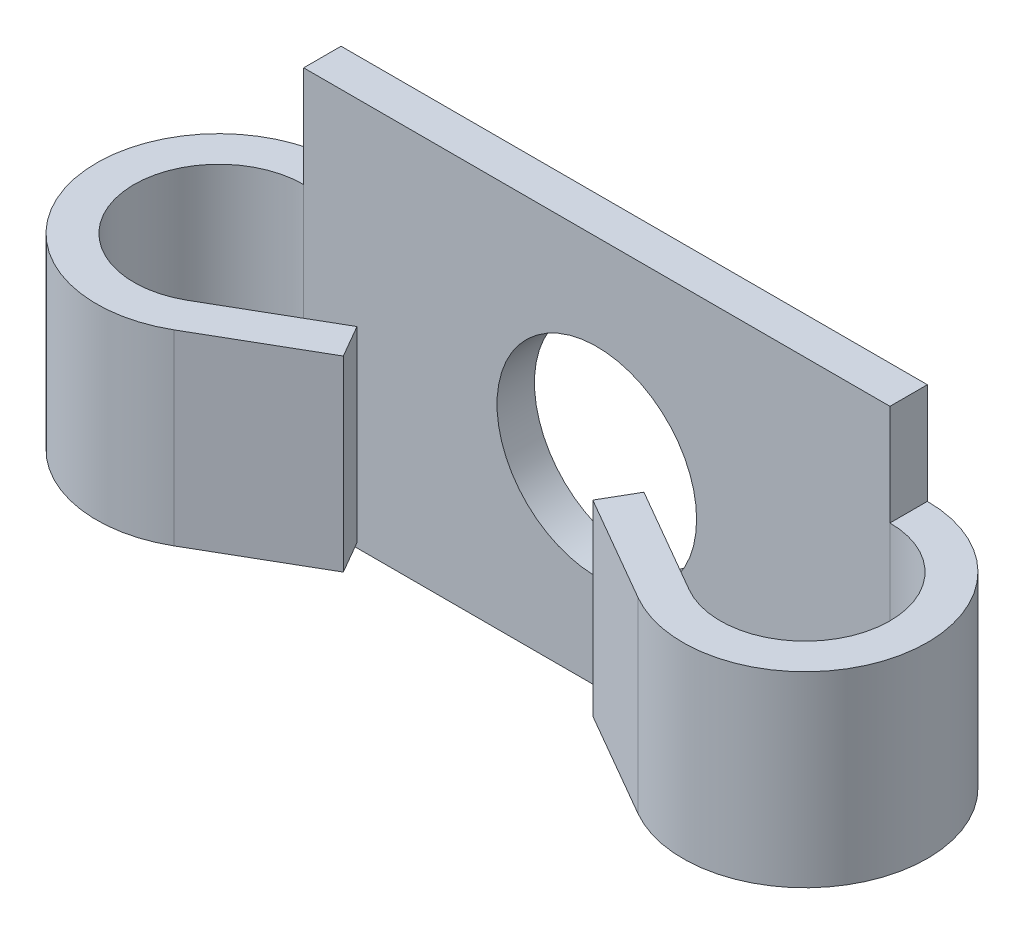
ISO-10303-21;
HEADER;
FILE_DESCRIPTION(('STEP AP214'),'2;1');
FILE_NAME('part.step','',(''),(''),'','','');
FILE_SCHEMA(('AUTOMOTIVE_DESIGN { 1 0 10303 214 1 1 1 1 }'));
ENDSEC;
DATA;
#1=APPLICATION_CONTEXT('core data for automotive mechanical design processes');
#2=APPLICATION_PROTOCOL_DEFINITION('international standard','automotive_design',2000,#1);
#3=PRODUCT_CONTEXT('',#1,'mechanical');
#4=PRODUCT('Part','Part','',(#3));
#5=PRODUCT_RELATED_PRODUCT_CATEGORY('part','',(#4));
#6=PRODUCT_DEFINITION_FORMATION('','',#4);
#7=PRODUCT_DEFINITION_CONTEXT('part definition',#1,'design');
#8=PRODUCT_DEFINITION('design','',#6,#7);
#9=PRODUCT_DEFINITION_SHAPE('','',#8);
#10=(LENGTH_UNIT() NAMED_UNIT(*) SI_UNIT(.MILLI.,.METRE.));
#11=(NAMED_UNIT(*) PLANE_ANGLE_UNIT() SI_UNIT($,.RADIAN.));
#12=(NAMED_UNIT(*) SI_UNIT($,.STERADIAN.) SOLID_ANGLE_UNIT());
#13=UNCERTAINTY_MEASURE_WITH_UNIT(LENGTH_MEASURE(1.E-05),#10,'distance_accuracy_value','');
#14=(GEOMETRIC_REPRESENTATION_CONTEXT(3) GLOBAL_UNCERTAINTY_ASSIGNED_CONTEXT((#13)) GLOBAL_UNIT_ASSIGNED_CONTEXT((#10,
#11,#12)) REPRESENTATION_CONTEXT('',''));
#15=CARTESIAN_POINT('',(0.,0.,0.));
#16=DIRECTION('',(0.,0.,1.));
#17=DIRECTION('',(1.,0.,0.));
#18=AXIS2_PLACEMENT_3D('',#15,#16,#17);
#19=CARTESIAN_POINT('',(11.75,-7.8,1.5));
#20=DIRECTION('',(-1.,0.,0.));
#21=DIRECTION('',(0.,0.,1.));
#22=AXIS2_PLACEMENT_3D('',#19,#20,#21);
#23=PLANE('',#22);
#24=DIRECTION('',(0.,0.,-1.));
#25=VECTOR('',#24,1.);
#26=CARTESIAN_POINT('',(11.75,-3.75,1.5));
#27=LINE('',#26,#25);
#28=CARTESIAN_POINT('',(11.75,-3.75,1.5));
#29=VERTEX_POINT('',#28);
#30=CARTESIAN_POINT('',(11.75,-3.75,0.));
#31=VERTEX_POINT('',#30);
#32=EDGE_CURVE('E58',#29,#31,#27,.T.);
#33=ORIENTED_EDGE('',*,*,#32,.F.);
#34=DIRECTION('',(0.,1.,0.));
#35=VECTOR('',#34,1.);
#36=CARTESIAN_POINT('',(11.75,-7.8,1.5));
#37=LINE('',#36,#35);
#38=CARTESIAN_POINT('',(11.75,-7.8,1.5));
#39=VERTEX_POINT('',#38);
#40=EDGE_CURVE('E258',#39,#29,#37,.T.);
#41=ORIENTED_EDGE('',*,*,#40,.F.);
#42=DIRECTION('',(0.,0.,-1.));
#43=VECTOR('',#42,1.);
#44=CARTESIAN_POINT('',(11.75,-7.8,1.5));
#45=LINE('',#44,#43);
#46=CARTESIAN_POINT('',(11.75,-7.8,0.));
#47=VERTEX_POINT('',#46);
#48=EDGE_CURVE('E268',#39,#47,#45,.T.);
#49=ORIENTED_EDGE('',*,*,#48,.T.);
#50=DIRECTION('',(0.,1.,0.));
#51=VECTOR('',#50,1.);
#52=CARTESIAN_POINT('',(11.75,-7.8,0.));
#53=LINE('',#52,#51);
#54=EDGE_CURVE('E269',#47,#31,#53,.T.);
#55=ORIENTED_EDGE('',*,*,#54,.T.);
#56=EDGE_LOOP('',(#33,#41,#49,#55));
#57=FACE_BOUND('',#56,.T.);
#58=ADVANCED_FACE('F35',(#57),#23,.F.);
#59=CARTESIAN_POINT('',(-11.75,-7.8,1.5));
#60=DIRECTION('',(1.,0.,0.));
#61=DIRECTION('',(0.,0.,-1.));
#62=AXIS2_PLACEMENT_3D('',#59,#60,#61);
#63=PLANE('',#62);
#64=DIRECTION('',(0.,0.,-1.));
#65=VECTOR('',#64,1.);
#66=CARTESIAN_POINT('',(-11.75,-3.75,1.5));
#67=LINE('',#66,#65);
#68=CARTESIAN_POINT('',(-11.75,-3.75,1.5));
#69=VERTEX_POINT('',#68);
#70=CARTESIAN_POINT('',(-11.75,-3.75,0.));
#71=VERTEX_POINT('',#70);
#72=EDGE_CURVE('E226',#69,#71,#67,.T.);
#73=ORIENTED_EDGE('',*,*,#72,.T.);
#74=DIRECTION('',(0.,-1.,0.));
#75=VECTOR('',#74,1.);
#76=CARTESIAN_POINT('',(-11.75,-7.8,0.));
#77=LINE('',#76,#75);
#78=CARTESIAN_POINT('',(-11.75,-7.8,0.));
#79=VERTEX_POINT('',#78);
#80=EDGE_CURVE('E273',#71,#79,#77,.T.);
#81=ORIENTED_EDGE('',*,*,#80,.T.);
#82=DIRECTION('',(0.,0.,-1.));
#83=VECTOR('',#82,1.);
#84=CARTESIAN_POINT('',(-11.75,-7.8,1.5));
#85=LINE('',#84,#83);
#86=CARTESIAN_POINT('',(-11.75,-7.8,1.5));
#87=VERTEX_POINT('',#86);
#88=EDGE_CURVE('E281',#87,#79,#85,.T.);
#89=ORIENTED_EDGE('',*,*,#88,.F.);
#90=DIRECTION('',(0.,-1.,0.));
#91=VECTOR('',#90,1.);
#92=CARTESIAN_POINT('',(-11.75,-7.8,1.5));
#93=LINE('',#92,#91);
#94=EDGE_CURVE('E262',#69,#87,#93,.T.);
#95=ORIENTED_EDGE('',*,*,#94,.F.);
#96=EDGE_LOOP('',(#73,#81,#89,#95));
#97=FACE_BOUND('',#96,.T.);
#98=ADVANCED_FACE('F352',(#97),#63,.F.);
#99=CARTESIAN_POINT('',(0.,0.,1.5));
#100=DIRECTION('',(0.,0.,-1.));
#101=DIRECTION('',(-1.,0.,0.));
#102=AXIS2_PLACEMENT_3D('',#99,#100,#101);
#103=PLANE('',#102);
#104=ORIENTED_EDGE('',*,*,#40,.T.);
#105=DIRECTION('',(0.,-1.,0.));
#106=VECTOR('',#105,1.);
#107=CARTESIAN_POINT('',(11.75,3.75,1.5));
#108=LINE('',#107,#106);
#109=CARTESIAN_POINT('',(11.75,3.75,1.5));
#110=VERTEX_POINT('',#109);
#111=EDGE_CURVE('E185',#110,#29,#108,.T.);
#112=ORIENTED_EDGE('',*,*,#111,.F.);
#113=CARTESIAN_POINT('',(11.75,7.8,1.5));
#114=VERTEX_POINT('',#113);
#115=EDGE_CURVE('E50',#110,#114,#37,.T.);
#116=ORIENTED_EDGE('',*,*,#115,.T.);
#117=DIRECTION('',(-1.,0.,0.));
#118=VECTOR('',#117,1.);
#119=CARTESIAN_POINT('',(-11.75,7.8,1.5));
#120=LINE('',#119,#118);
#121=CARTESIAN_POINT('',(-11.75,7.8,1.5));
#122=VERTEX_POINT('',#121);
#123=EDGE_CURVE('E260',#114,#122,#120,.T.);
#124=ORIENTED_EDGE('',*,*,#123,.T.);
#125=CARTESIAN_POINT('',(-11.75,3.75,1.5));
#126=VERTEX_POINT('',#125);
#127=EDGE_CURVE('E263',#122,#126,#93,.T.);
#128=ORIENTED_EDGE('',*,*,#127,.T.);
#129=DIRECTION('',(0.,-1.,0.));
#130=VECTOR('',#129,1.);
#131=CARTESIAN_POINT('',(-11.75,3.75,1.5));
#132=LINE('',#131,#130);
#133=EDGE_CURVE('E249',#126,#69,#132,.T.);
#134=ORIENTED_EDGE('',*,*,#133,.T.);
#135=ORIENTED_EDGE('',*,*,#94,.T.);
#136=DIRECTION('',(1.,0.,0.));
#137=VECTOR('',#136,1.);
#138=CARTESIAN_POINT('',(-11.75,-7.8,1.5));
#139=LINE('',#138,#137);
#140=EDGE_CURVE('E266',#87,#39,#139,.T.);
#141=ORIENTED_EDGE('',*,*,#140,.T.);
#142=EDGE_LOOP('',(#104,#112,#116,#124,#128,#134,#135,#141));
#143=FACE_BOUND('',#142,.T.);
#144=CARTESIAN_POINT('',(0.,0.,1.5));
#145=DIRECTION('',(0.,0.,1.));
#146=DIRECTION('',(1.,0.,0.));
#147=AXIS2_PLACEMENT_3D('',#144,#145,#146);
#148=CIRCLE('',#147,4.);
#149=CARTESIAN_POINT('',(4.,0.,1.5));
#150=VERTEX_POINT('',#149);
#151=EDGE_CURVE('E252',#150,#150,#148,.T.);
#152=ORIENTED_EDGE('',*,*,#151,.F.);
#153=EDGE_LOOP('',(#152));
#154=FACE_BOUND('',#153,.T.);
#155=ADVANCED_FACE('F326',(#143,#154),#103,.F.);
#156=CARTESIAN_POINT('',(0.,0.,0.));
#157=DIRECTION('',(0.,0.,-1.));
#158=DIRECTION('',(-1.,0.,0.));
#159=AXIS2_PLACEMENT_3D('',#156,#157,#158);
#160=PLANE('',#159);
#161=ORIENTED_EDGE('',*,*,#54,.F.);
#162=DIRECTION('',(1.,0.,0.));
#163=VECTOR('',#162,1.);
#164=CARTESIAN_POINT('',(-11.75,-7.8,0.));
#165=LINE('',#164,#163);
#166=EDGE_CURVE('E277',#79,#47,#165,.T.);
#167=ORIENTED_EDGE('',*,*,#166,.F.);
#168=ORIENTED_EDGE('',*,*,#80,.F.);
#169=DIRECTION('',(0.,-1.,0.));
#170=VECTOR('',#169,1.);
#171=CARTESIAN_POINT('',(-11.75,3.75,0.));
#172=LINE('',#171,#170);
#173=CARTESIAN_POINT('',(-11.75,3.75,0.));
#174=VERTEX_POINT('',#173);
#175=EDGE_CURVE('E246',#174,#71,#172,.T.);
#176=ORIENTED_EDGE('',*,*,#175,.F.);
#177=CARTESIAN_POINT('',(-11.75,7.8,0.));
#178=VERTEX_POINT('',#177);
#179=EDGE_CURVE('E274',#178,#174,#77,.T.);
#180=ORIENTED_EDGE('',*,*,#179,.F.);
#181=DIRECTION('',(-1.,0.,0.));
#182=VECTOR('',#181,1.);
#183=CARTESIAN_POINT('',(-11.75,7.8,0.));
#184=LINE('',#183,#182);
#185=CARTESIAN_POINT('',(11.75,7.8,0.));
#186=VERTEX_POINT('',#185);
#187=EDGE_CURVE('E271',#186,#178,#184,.T.);
#188=ORIENTED_EDGE('',*,*,#187,.F.);
#189=CARTESIAN_POINT('',(11.75,3.75,0.));
#190=VERTEX_POINT('',#189);
#191=EDGE_CURVE('E255',#190,#186,#53,.T.);
#192=ORIENTED_EDGE('',*,*,#191,.F.);
#193=DIRECTION('',(0.,-1.,0.));
#194=VECTOR('',#193,1.);
#195=CARTESIAN_POINT('',(11.75,3.75,0.));
#196=LINE('',#195,#194);
#197=EDGE_CURVE('E200',#190,#31,#196,.T.);
#198=ORIENTED_EDGE('',*,*,#197,.T.);
#199=EDGE_LOOP('',(#161,#167,#168,#176,#180,#188,#192,#198));
#200=FACE_BOUND('',#199,.T.);
#201=CARTESIAN_POINT('',(0.,0.,0.));
#202=DIRECTION('',(0.,0.,1.));
#203=DIRECTION('',(1.,0.,0.));
#204=AXIS2_PLACEMENT_3D('',#201,#202,#203);
#205=CIRCLE('',#204,4.);
#206=CARTESIAN_POINT('',(4.,0.,0.));
#207=VERTEX_POINT('',#206);
#208=EDGE_CURVE('E251',#207,#207,#205,.T.);
#209=ORIENTED_EDGE('',*,*,#208,.T.);
#210=EDGE_LOOP('',(#209));
#211=FACE_BOUND('',#210,.T.);
#212=ADVANCED_FACE('F294',(#200,#211),#160,.T.);
#213=ORIENTED_EDGE('',*,*,#115,.F.);
#214=DIRECTION('',(0.,0.,-1.));
#215=VECTOR('',#214,1.);
#216=CARTESIAN_POINT('',(11.75,3.75,1.5));
#217=LINE('',#216,#215);
#218=EDGE_CURVE('E171',#110,#190,#217,.T.);
#219=ORIENTED_EDGE('',*,*,#218,.T.);
#220=ORIENTED_EDGE('',*,*,#191,.T.);
#221=DIRECTION('',(0.,0.,-1.));
#222=VECTOR('',#221,1.);
#223=CARTESIAN_POINT('',(11.75,7.8,1.5));
#224=LINE('',#223,#222);
#225=EDGE_CURVE('E11',#114,#186,#224,.T.);
#226=ORIENTED_EDGE('',*,*,#225,.F.);
#227=EDGE_LOOP('',(#213,#219,#220,#226));
#228=FACE_BOUND('',#227,.T.);
#229=ADVANCED_FACE('F37',(#228),#23,.F.);
#230=CARTESIAN_POINT('',(-11.75,7.8,1.5));
#231=DIRECTION('',(0.,-1.,0.));
#232=DIRECTION('',(0.,0.,-1.));
#233=AXIS2_PLACEMENT_3D('',#230,#231,#232);
#234=PLANE('',#233);
#235=ORIENTED_EDGE('',*,*,#187,.T.);
#236=DIRECTION('',(0.,0.,-1.));
#237=VECTOR('',#236,1.);
#238=CARTESIAN_POINT('',(-11.75,7.8,1.5));
#239=LINE('',#238,#237);
#240=EDGE_CURVE('E43',#122,#178,#239,.T.);
#241=ORIENTED_EDGE('',*,*,#240,.F.);
#242=ORIENTED_EDGE('',*,*,#123,.F.);
#243=ORIENTED_EDGE('',*,*,#225,.T.);
#244=EDGE_LOOP('',(#235,#241,#242,#243));
#245=FACE_BOUND('',#244,.T.);
#246=ADVANCED_FACE('F329',(#245),#234,.F.);
#247=ORIENTED_EDGE('',*,*,#179,.T.);
#248=DIRECTION('',(0.,0.,-1.));
#249=VECTOR('',#248,1.);
#250=CARTESIAN_POINT('',(-11.75,3.75,1.5));
#251=LINE('',#250,#249);
#252=EDGE_CURVE('E211',#126,#174,#251,.T.);
#253=ORIENTED_EDGE('',*,*,#252,.F.);
#254=ORIENTED_EDGE('',*,*,#127,.F.);
#255=ORIENTED_EDGE('',*,*,#240,.T.);
#256=EDGE_LOOP('',(#247,#253,#254,#255));
#257=FACE_BOUND('',#256,.T.);
#258=ADVANCED_FACE('F288',(#257),#63,.F.);
#259=CARTESIAN_POINT('',(-11.75,-7.8,1.5));
#260=DIRECTION('',(0.,1.,0.));
#261=DIRECTION('',(0.,0.,1.));
#262=AXIS2_PLACEMENT_3D('',#259,#260,#261);
#263=PLANE('',#262);
#264=ORIENTED_EDGE('',*,*,#166,.T.);
#265=ORIENTED_EDGE('',*,*,#48,.F.);
#266=ORIENTED_EDGE('',*,*,#140,.F.);
#267=ORIENTED_EDGE('',*,*,#88,.T.);
#268=EDGE_LOOP('',(#264,#265,#266,#267));
#269=FACE_BOUND('',#268,.T.);
#270=ADVANCED_FACE('F370',(#269),#263,.F.);
#271=CARTESIAN_POINT('',(0.,0.,1.5));
#272=DIRECTION('',(0.,0.,-1.));
#273=DIRECTION('',(-1.,0.,0.));
#274=AXIS2_PLACEMENT_3D('',#271,#272,#273);
#275=CYLINDRICAL_SURFACE('',#274,4.);
#276=ORIENTED_EDGE('',*,*,#151,.T.);
#277=EDGE_LOOP('',(#276));
#278=FACE_BOUND('',#277,.T.);
#279=ORIENTED_EDGE('',*,*,#208,.F.);
#280=EDGE_LOOP('',(#279));
#281=FACE_BOUND('',#280,.T.);
#282=ADVANCED_FACE('F372',(#278,#281),#275,.F.);
#283=CARTESIAN_POINT('',(-11.75,3.75,4.9));
#284=DIRECTION('',(0.,-1.,0.));
#285=DIRECTION('',(0.,0.,-1.));
#286=AXIS2_PLACEMENT_3D('',#283,#284,#285);
#287=CYLINDRICAL_SURFACE('',#286,3.4);
#288=CARTESIAN_POINT('',(-11.75,-3.75,4.9));
#289=DIRECTION('',(0.,-1.,0.));
#290=DIRECTION('',(0.,0.,1.));
#291=AXIS2_PLACEMENT_3D('',#288,#289,#290);
#292=CIRCLE('',#291,3.4);
#293=CARTESIAN_POINT('',(-10.05,-3.75,7.8444863728671));
#294=VERTEX_POINT('',#293);
#295=EDGE_CURVE('E161',#294,#69,#292,.T.);
#296=ORIENTED_EDGE('',*,*,#295,.T.);
#297=ORIENTED_EDGE('',*,*,#133,.F.);
#298=CARTESIAN_POINT('',(-11.75,3.75,4.9));
#299=DIRECTION('',(0.,-1.,0.));
#300=DIRECTION('',(0.,0.,1.));
#301=AXIS2_PLACEMENT_3D('',#298,#299,#300);
#302=CIRCLE('',#301,3.4);
#303=CARTESIAN_POINT('',(-10.05,3.75,7.8444863728671));
#304=VERTEX_POINT('',#303);
#305=EDGE_CURVE('E208',#304,#126,#302,.T.);
#306=ORIENTED_EDGE('',*,*,#305,.F.);
#307=DIRECTION('',(0.,-1.,0.));
#308=VECTOR('',#307,1.);
#309=CARTESIAN_POINT('',(-10.05,3.75,7.8444863728671));
#310=LINE('',#309,#308);
#311=EDGE_CURVE('E223',#304,#294,#310,.T.);
#312=ORIENTED_EDGE('',*,*,#311,.T.);
#313=EDGE_LOOP('',(#296,#297,#306,#312));
#314=FACE_BOUND('',#313,.T.);
#315=ADVANCED_FACE('F391',(#314),#287,.F.);
#316=CARTESIAN_POINT('',(-11.75,3.75,4.9));
#317=DIRECTION('',(0.,-1.,0.));
#318=DIRECTION('',(0.,0.,-1.));
#319=AXIS2_PLACEMENT_3D('',#316,#317,#318);
#320=CYLINDRICAL_SURFACE('',#319,4.9);
#321=CARTESIAN_POINT('',(-11.75,-3.75,4.9));
#322=DIRECTION('',(0.,1.,0.));
#323=DIRECTION('',(0.,0.,1.));
#324=AXIS2_PLACEMENT_3D('',#321,#322,#323);
#325=CIRCLE('',#324,4.9);
#326=CARTESIAN_POINT('',(-9.30000000000002,-3.75,9.14352447854376));
#327=VERTEX_POINT('',#326);
#328=EDGE_CURVE('E228',#71,#327,#325,.T.);
#329=ORIENTED_EDGE('',*,*,#328,.T.);
#330=DIRECTION('',(0.,-1.,0.));
#331=VECTOR('',#330,1.);
#332=CARTESIAN_POINT('',(-9.30000000000002,3.75,9.14352447854376));
#333=LINE('',#332,#331);
#334=CARTESIAN_POINT('',(-9.30000000000002,3.75,9.14352447854376));
#335=VERTEX_POINT('',#334);
#336=EDGE_CURVE('E243',#335,#327,#333,.T.);
#337=ORIENTED_EDGE('',*,*,#336,.F.);
#338=CARTESIAN_POINT('',(-11.75,3.75,4.9));
#339=DIRECTION('',(0.,1.,0.));
#340=DIRECTION('',(0.,0.,1.));
#341=AXIS2_PLACEMENT_3D('',#338,#339,#340);
#342=CIRCLE('',#341,4.9);
#343=EDGE_CURVE('E215',#174,#335,#342,.T.);
#344=ORIENTED_EDGE('',*,*,#343,.F.);
#345=ORIENTED_EDGE('',*,*,#175,.T.);
#346=EDGE_LOOP('',(#329,#337,#344,#345));
#347=FACE_BOUND('',#346,.T.);
#348=ADVANCED_FACE('F302',(#347),#320,.T.);
#349=CARTESIAN_POINT('',(-5.,3.75,6.66091832102839));
#350=DIRECTION('',(-0.499999999999995,0.,-0.866025403784441));
#351=DIRECTION('',(-0.866025403784441,0.,0.499999999999995));
#352=AXIS2_PLACEMENT_3D('',#349,#350,#351);
#353=PLANE('',#352);
#354=DIRECTION('',(0.866025403784441,0.,-0.499999999999995));
#355=VECTOR('',#354,1.);
#356=CARTESIAN_POINT('',(-5.,-3.75,6.66091832102839));
#357=LINE('',#356,#355);
#358=CARTESIAN_POINT('',(-5.,-3.75,6.66091832102839));
#359=VERTEX_POINT('',#358);
#360=EDGE_CURVE('E230',#327,#359,#357,.T.);
#361=ORIENTED_EDGE('',*,*,#360,.T.);
#362=DIRECTION('',(0.,-1.,0.));
#363=VECTOR('',#362,1.);
#364=CARTESIAN_POINT('',(-5.,3.75,6.66091832102839));
#365=LINE('',#364,#363);
#366=CARTESIAN_POINT('',(-5.,3.75,6.66091832102839));
#367=VERTEX_POINT('',#366);
#368=EDGE_CURVE('E240',#367,#359,#365,.T.);
#369=ORIENTED_EDGE('',*,*,#368,.F.);
#370=DIRECTION('',(0.866025403784441,0.,-0.499999999999995));
#371=VECTOR('',#370,1.);
#372=CARTESIAN_POINT('',(-5.,3.75,6.66091832102839));
#373=LINE('',#372,#371);
#374=EDGE_CURVE('E217',#335,#367,#373,.T.);
#375=ORIENTED_EDGE('',*,*,#374,.F.);
#376=ORIENTED_EDGE('',*,*,#336,.T.);
#377=EDGE_LOOP('',(#361,#369,#375,#376));
#378=FACE_BOUND('',#377,.T.);
#379=ADVANCED_FACE('F313',(#378),#353,.F.);
#380=CARTESIAN_POINT('',(-5.74999999999999,3.75,5.36188021535173));
#381=DIRECTION('',(-0.866025403784442,0.,0.499999999999995));
#382=DIRECTION('',(0.499999999999995,0.,0.866025403784442));
#383=AXIS2_PLACEMENT_3D('',#380,#381,#382);
#384=PLANE('',#383);
#385=DIRECTION('',(-0.499999999999995,0.,-0.866025403784442));
#386=VECTOR('',#385,1.);
#387=CARTESIAN_POINT('',(-5.74999999999999,-3.75,5.36188021535173));
#388=LINE('',#387,#386);
#389=CARTESIAN_POINT('',(-5.74999999999999,-3.75,5.36188021535173));
#390=VERTEX_POINT('',#389);
#391=EDGE_CURVE('E232',#359,#390,#388,.T.);
#392=ORIENTED_EDGE('',*,*,#391,.T.);
#393=DIRECTION('',(0.,-1.,0.));
#394=VECTOR('',#393,1.);
#395=CARTESIAN_POINT('',(-5.74999999999999,3.75,5.36188021535173));
#396=LINE('',#395,#394);
#397=CARTESIAN_POINT('',(-5.74999999999999,3.75,5.36188021535173));
#398=VERTEX_POINT('',#397);
#399=EDGE_CURVE('E237',#398,#390,#396,.T.);
#400=ORIENTED_EDGE('',*,*,#399,.F.);
#401=DIRECTION('',(-0.499999999999995,0.,-0.866025403784442));
#402=VECTOR('',#401,1.);
#403=CARTESIAN_POINT('',(-5.74999999999999,3.75,5.36188021535173));
#404=LINE('',#403,#402);
#405=EDGE_CURVE('E219',#367,#398,#404,.T.);
#406=ORIENTED_EDGE('',*,*,#405,.F.);
#407=ORIENTED_EDGE('',*,*,#368,.T.);
#408=EDGE_LOOP('',(#392,#400,#406,#407));
#409=FACE_BOUND('',#408,.T.);
#410=ADVANCED_FACE('F317',(#409),#384,.F.);
#411=CARTESIAN_POINT('',(-10.05,3.75,7.8444863728671));
#412=DIRECTION('',(0.499999999999995,0.,0.866025403784442));
#413=DIRECTION('',(0.866025403784442,0.,-0.499999999999995));
#414=AXIS2_PLACEMENT_3D('',#411,#412,#413);
#415=PLANE('',#414);
#416=DIRECTION('',(-0.866025403784442,0.,0.499999999999995));
#417=VECTOR('',#416,1.);
#418=CARTESIAN_POINT('',(-10.05,-3.75,7.8444863728671));
#419=LINE('',#418,#417);
#420=EDGE_CURVE('E212',#390,#294,#419,.T.);
#421=ORIENTED_EDGE('',*,*,#420,.T.);
#422=ORIENTED_EDGE('',*,*,#311,.F.);
#423=DIRECTION('',(-0.866025403784442,0.,0.499999999999995));
#424=VECTOR('',#423,1.);
#425=CARTESIAN_POINT('',(-10.05,3.75,7.8444863728671));
#426=LINE('',#425,#424);
#427=EDGE_CURVE('E221',#398,#304,#426,.T.);
#428=ORIENTED_EDGE('',*,*,#427,.F.);
#429=ORIENTED_EDGE('',*,*,#399,.T.);
#430=EDGE_LOOP('',(#421,#422,#428,#429));
#431=FACE_BOUND('',#430,.T.);
#432=ADVANCED_FACE('F416',(#431),#415,.F.);
#433=CARTESIAN_POINT('',(-11.75,3.75,4.9));
#434=DIRECTION('',(0.,1.,0.));
#435=DIRECTION('',(0.,0.,1.));
#436=AXIS2_PLACEMENT_3D('',#433,#434,#435);
#437=PLANE('',#436);
#438=ORIENTED_EDGE('',*,*,#305,.T.);
#439=ORIENTED_EDGE('',*,*,#252,.T.);
#440=ORIENTED_EDGE('',*,*,#343,.T.);
#441=ORIENTED_EDGE('',*,*,#374,.T.);
#442=ORIENTED_EDGE('',*,*,#405,.T.);
#443=ORIENTED_EDGE('',*,*,#427,.T.);
#444=EDGE_LOOP('',(#438,#439,#440,#441,#442,#443));
#445=FACE_BOUND('',#444,.T.);
#446=ADVANCED_FACE('F321',(#445),#437,.T.);
#447=CARTESIAN_POINT('',(-11.75,-3.75,4.9));
#448=DIRECTION('',(0.,1.,0.));
#449=DIRECTION('',(0.,0.,1.));
#450=AXIS2_PLACEMENT_3D('',#447,#448,#449);
#451=PLANE('',#450);
#452=ORIENTED_EDGE('',*,*,#295,.F.);
#453=ORIENTED_EDGE('',*,*,#420,.F.);
#454=ORIENTED_EDGE('',*,*,#391,.F.);
#455=ORIENTED_EDGE('',*,*,#360,.F.);
#456=ORIENTED_EDGE('',*,*,#328,.F.);
#457=ORIENTED_EDGE('',*,*,#72,.F.);
#458=EDGE_LOOP('',(#452,#453,#454,#455,#456,#457));
#459=FACE_BOUND('',#458,.T.);
#460=ADVANCED_FACE('F308',(#459),#451,.F.);
#461=CARTESIAN_POINT('',(11.75,3.75,4.9));
#462=DIRECTION('',(0.,-1.,0.));
#463=DIRECTION('',(0.,0.,-1.));
#464=AXIS2_PLACEMENT_3D('',#461,#462,#463);
#465=CYLINDRICAL_SURFACE('',#464,3.4);
#466=CARTESIAN_POINT('',(11.75,-3.75,4.9));
#467=DIRECTION('',(0.,1.,0.));
#468=DIRECTION('',(0.,0.,1.));
#469=AXIS2_PLACEMENT_3D('',#466,#467,#468);
#470=CIRCLE('',#469,3.4);
#471=CARTESIAN_POINT('',(10.05,-3.75,7.8444863728671));
#472=VERTEX_POINT('',#471);
#473=EDGE_CURVE('E156',#472,#29,#470,.T.);
#474=ORIENTED_EDGE('',*,*,#473,.F.);
#475=DIRECTION('',(0.,-1.,0.));
#476=VECTOR('',#475,1.);
#477=CARTESIAN_POINT('',(10.05,3.75,7.8444863728671));
#478=LINE('',#477,#476);
#479=CARTESIAN_POINT('',(10.05,3.75,7.8444863728671));
#480=VERTEX_POINT('',#479);
#481=EDGE_CURVE('E149',#480,#472,#478,.T.);
#482=ORIENTED_EDGE('',*,*,#481,.F.);
#483=CARTESIAN_POINT('',(11.75,3.75,4.9));
#484=DIRECTION('',(0.,1.,0.));
#485=DIRECTION('',(0.,0.,1.));
#486=AXIS2_PLACEMENT_3D('',#483,#484,#485);
#487=CIRCLE('',#486,3.4);
#488=EDGE_CURVE('E153',#480,#110,#487,.T.);
#489=ORIENTED_EDGE('',*,*,#488,.T.);
#490=ORIENTED_EDGE('',*,*,#111,.T.);
#491=EDGE_LOOP('',(#474,#482,#489,#490));
#492=FACE_BOUND('',#491,.T.);
#493=ADVANCED_FACE('F151',(#492),#465,.F.);
#494=CARTESIAN_POINT('',(10.05,3.75,7.8444863728671));
#495=DIRECTION('',(0.499999999999995,0.,-0.866025403784442));
#496=DIRECTION('',(-0.866025403784442,0.,-0.499999999999995));
#497=AXIS2_PLACEMENT_3D('',#494,#495,#496);
#498=PLANE('',#497);
#499=DIRECTION('',(0.866025403784442,0.,0.499999999999995));
#500=VECTOR('',#499,1.);
#501=CARTESIAN_POINT('',(10.05,-3.75,7.8444863728671));
#502=LINE('',#501,#500);
#503=CARTESIAN_POINT('',(5.74999999999999,-3.75,5.36188021535173));
#504=VERTEX_POINT('',#503);
#505=EDGE_CURVE('E187',#504,#472,#502,.T.);
#506=ORIENTED_EDGE('',*,*,#505,.F.);
#507=DIRECTION('',(0.,-1.,0.));
#508=VECTOR('',#507,1.);
#509=CARTESIAN_POINT('',(5.74999999999999,3.75,5.36188021535173));
#510=LINE('',#509,#508);
#511=CARTESIAN_POINT('',(5.74999999999999,3.75,5.36188021535173));
#512=VERTEX_POINT('',#511);
#513=EDGE_CURVE('E162',#512,#504,#510,.T.);
#514=ORIENTED_EDGE('',*,*,#513,.F.);
#515=DIRECTION('',(0.866025403784442,0.,0.499999999999995));
#516=VECTOR('',#515,1.);
#517=CARTESIAN_POINT('',(10.05,3.75,7.8444863728671));
#518=LINE('',#517,#516);
#519=EDGE_CURVE('E168',#512,#480,#518,.T.);
#520=ORIENTED_EDGE('',*,*,#519,.T.);
#521=ORIENTED_EDGE('',*,*,#481,.T.);
#522=EDGE_LOOP('',(#506,#514,#520,#521));
#523=FACE_BOUND('',#522,.T.);
#524=ADVANCED_FACE('F173',(#523),#498,.T.);
#525=CARTESIAN_POINT('',(5.74999999999999,3.75,5.36188021535173));
#526=DIRECTION('',(-0.866025403784442,0.,-0.499999999999995));
#527=DIRECTION('',(-0.499999999999995,0.,0.866025403784442));
#528=AXIS2_PLACEMENT_3D('',#525,#526,#527);
#529=PLANE('',#528);
#530=DIRECTION('',(0.499999999999995,0.,-0.866025403784442));
#531=VECTOR('',#530,1.);
#532=CARTESIAN_POINT('',(5.74999999999999,-3.75,5.36188021535173));
#533=LINE('',#532,#531);
#534=CARTESIAN_POINT('',(5.,-3.75,6.66091832102839));
#535=VERTEX_POINT('',#534);
#536=EDGE_CURVE('E189',#535,#504,#533,.T.);
#537=ORIENTED_EDGE('',*,*,#536,.F.);
#538=DIRECTION('',(0.,-1.,0.));
#539=VECTOR('',#538,1.);
#540=CARTESIAN_POINT('',(5.,3.75,6.66091832102839));
#541=LINE('',#540,#539);
#542=CARTESIAN_POINT('',(5.,3.75,6.66091832102839));
#543=VERTEX_POINT('',#542);
#544=EDGE_CURVE('E205',#543,#535,#541,.T.);
#545=ORIENTED_EDGE('',*,*,#544,.F.);
#546=DIRECTION('',(0.499999999999995,0.,-0.866025403784442));
#547=VECTOR('',#546,1.);
#548=CARTESIAN_POINT('',(5.74999999999999,3.75,5.36188021535173));
#549=LINE('',#548,#547);
#550=EDGE_CURVE('E174',#543,#512,#549,.T.);
#551=ORIENTED_EDGE('',*,*,#550,.T.);
#552=ORIENTED_EDGE('',*,*,#513,.T.);
#553=EDGE_LOOP('',(#537,#545,#551,#552));
#554=FACE_BOUND('',#553,.T.);
#555=ADVANCED_FACE('F342',(#554),#529,.T.);
#556=CARTESIAN_POINT('',(5.,3.75,6.66091832102839));
#557=DIRECTION('',(-0.499999999999995,0.,0.866025403784441));
#558=DIRECTION('',(0.866025403784441,0.,0.499999999999995));
#559=AXIS2_PLACEMENT_3D('',#556,#557,#558);
#560=PLANE('',#559);
#561=DIRECTION('',(-0.866025403784441,0.,-0.499999999999995));
#562=VECTOR('',#561,1.);
#563=CARTESIAN_POINT('',(5.,-3.75,6.66091832102839));
#564=LINE('',#563,#562);
#565=CARTESIAN_POINT('',(9.30000000000002,-3.75,9.14352447854376));
#566=VERTEX_POINT('',#565);
#567=EDGE_CURVE('E192',#566,#535,#564,.T.);
#568=ORIENTED_EDGE('',*,*,#567,.F.);
#569=DIRECTION('',(0.,-1.,0.));
#570=VECTOR('',#569,1.);
#571=CARTESIAN_POINT('',(9.30000000000002,3.75,9.14352447854376));
#572=LINE('',#571,#570);
#573=CARTESIAN_POINT('',(9.30000000000002,3.75,9.14352447854376));
#574=VERTEX_POINT('',#573);
#575=EDGE_CURVE('E203',#574,#566,#572,.T.);
#576=ORIENTED_EDGE('',*,*,#575,.F.);
#577=DIRECTION('',(-0.866025403784441,0.,-0.499999999999995));
#578=VECTOR('',#577,1.);
#579=CARTESIAN_POINT('',(5.,3.75,6.66091832102839));
#580=LINE('',#579,#578);
#581=EDGE_CURVE('E176',#574,#543,#580,.T.);
#582=ORIENTED_EDGE('',*,*,#581,.T.);
#583=ORIENTED_EDGE('',*,*,#544,.T.);
#584=EDGE_LOOP('',(#568,#576,#582,#583));
#585=FACE_BOUND('',#584,.T.);
#586=ADVANCED_FACE('F337',(#585),#560,.T.);
#587=CARTESIAN_POINT('',(11.75,3.75,4.9));
#588=DIRECTION('',(0.,-1.,0.));
#589=DIRECTION('',(0.,0.,-1.));
#590=AXIS2_PLACEMENT_3D('',#587,#588,#589);
#591=CYLINDRICAL_SURFACE('',#590,4.9);
#592=CARTESIAN_POINT('',(11.75,-3.75,4.9));
#593=DIRECTION('',(0.,-1.,0.));
#594=DIRECTION('',(0.,0.,1.));
#595=AXIS2_PLACEMENT_3D('',#592,#593,#594);
#596=CIRCLE('',#595,4.9);
#597=EDGE_CURVE('E195',#31,#566,#596,.T.);
#598=ORIENTED_EDGE('',*,*,#597,.F.);
#599=ORIENTED_EDGE('',*,*,#197,.F.);
#600=CARTESIAN_POINT('',(11.75,3.75,4.9));
#601=DIRECTION('',(0.,-1.,0.));
#602=DIRECTION('',(0.,0.,1.));
#603=AXIS2_PLACEMENT_3D('',#600,#601,#602);
#604=CIRCLE('',#603,4.9);
#605=EDGE_CURVE('E181',#190,#574,#604,.T.);
#606=ORIENTED_EDGE('',*,*,#605,.T.);
#607=ORIENTED_EDGE('',*,*,#575,.T.);
#608=EDGE_LOOP('',(#598,#599,#606,#607));
#609=FACE_BOUND('',#608,.T.);
#610=ADVANCED_FACE('F333',(#609),#591,.T.);
#611=CARTESIAN_POINT('',(11.75,3.75,4.9));
#612=DIRECTION('',(0.,1.,0.));
#613=DIRECTION('',(0.,0.,1.));
#614=AXIS2_PLACEMENT_3D('',#611,#612,#613);
#615=PLANE('',#614);
#616=ORIENTED_EDGE('',*,*,#488,.F.);
#617=ORIENTED_EDGE('',*,*,#519,.F.);
#618=ORIENTED_EDGE('',*,*,#550,.F.);
#619=ORIENTED_EDGE('',*,*,#581,.F.);
#620=ORIENTED_EDGE('',*,*,#605,.F.);
#621=ORIENTED_EDGE('',*,*,#218,.F.);
#622=EDGE_LOOP('',(#616,#617,#618,#619,#620,#621));
#623=FACE_BOUND('',#622,.T.);
#624=ADVANCED_FACE('F166',(#623),#615,.T.);
#625=CARTESIAN_POINT('',(11.75,-3.75,4.9));
#626=DIRECTION('',(0.,1.,0.));
#627=DIRECTION('',(0.,0.,1.));
#628=AXIS2_PLACEMENT_3D('',#625,#626,#627);
#629=PLANE('',#628);
#630=ORIENTED_EDGE('',*,*,#473,.T.);
#631=ORIENTED_EDGE('',*,*,#32,.T.);
#632=ORIENTED_EDGE('',*,*,#597,.T.);
#633=ORIENTED_EDGE('',*,*,#567,.T.);
#634=ORIENTED_EDGE('',*,*,#536,.T.);
#635=ORIENTED_EDGE('',*,*,#505,.T.);
#636=EDGE_LOOP('',(#630,#631,#632,#633,#634,#635));
#637=FACE_BOUND('',#636,.T.);
#638=ADVANCED_FACE('F340',(#637),#629,.F.);
#639=CLOSED_SHELL('',(#58,#98,#155,#212,#229,#246,#258,#270,#282,#315,#348,#379,#410,#432,#446,
#460,#493,#524,#555,#586,#610,#624,#638));
#640=MANIFOLD_SOLID_BREP('B2',#639);
#641=ADVANCED_BREP_SHAPE_REPRESENTATION('',(#18,#640),#14);
#642=SHAPE_DEFINITION_REPRESENTATION(#9,#641);
ENDSEC;
END-ISO-10303-21;
